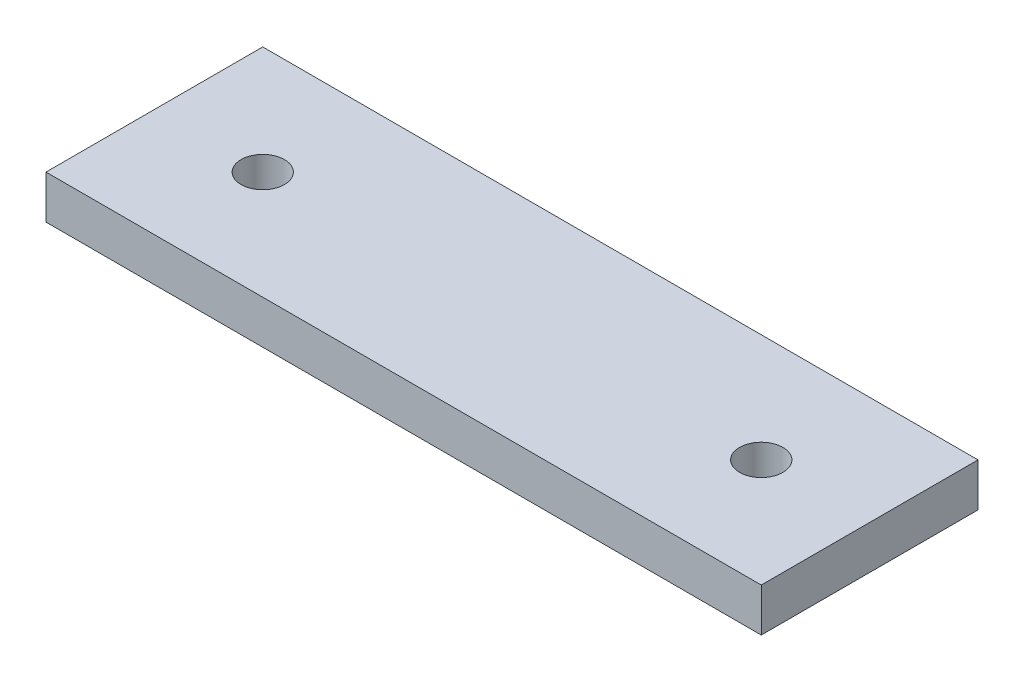
ISO-10303-21;
HEADER;
FILE_DESCRIPTION(('STEP AP214'),'2;1');
FILE_NAME('part.step','',(''),(''),'','','');
FILE_SCHEMA(('AUTOMOTIVE_DESIGN { 1 0 10303 214 1 1 1 1 }'));
ENDSEC;
DATA;
#1=APPLICATION_CONTEXT('core data for automotive mechanical design processes');
#2=APPLICATION_PROTOCOL_DEFINITION('international standard','automotive_design',2000,#1);
#3=PRODUCT_CONTEXT('',#1,'mechanical');
#4=PRODUCT('Part','Part','',(#3));
#5=PRODUCT_RELATED_PRODUCT_CATEGORY('part','',(#4));
#6=PRODUCT_DEFINITION_FORMATION('','',#4);
#7=PRODUCT_DEFINITION_CONTEXT('part definition',#1,'design');
#8=PRODUCT_DEFINITION('design','',#6,#7);
#9=PRODUCT_DEFINITION_SHAPE('','',#8);
#10=(LENGTH_UNIT() NAMED_UNIT(*) SI_UNIT(.MILLI.,.METRE.));
#11=(NAMED_UNIT(*) PLANE_ANGLE_UNIT() SI_UNIT($,.RADIAN.));
#12=(NAMED_UNIT(*) SI_UNIT($,.STERADIAN.) SOLID_ANGLE_UNIT());
#13=UNCERTAINTY_MEASURE_WITH_UNIT(LENGTH_MEASURE(1.E-05),#10,'distance_accuracy_value','');
#14=(GEOMETRIC_REPRESENTATION_CONTEXT(3) GLOBAL_UNCERTAINTY_ASSIGNED_CONTEXT((#13)) GLOBAL_UNIT_ASSIGNED_CONTEXT((#10,
#11,#12)) REPRESENTATION_CONTEXT('',''));
#15=CARTESIAN_POINT('',(0.,0.,0.));
#16=DIRECTION('',(0.,0.,1.));
#17=DIRECTION('',(1.,0.,0.));
#18=AXIS2_PLACEMENT_3D('',#15,#16,#17);
#19=CARTESIAN_POINT('',(0.,4.,0.));
#20=DIRECTION('',(1.,0.,0.));
#21=DIRECTION('',(0.,0.,-1.));
#22=AXIS2_PLACEMENT_3D('',#19,#20,#21);
#23=PLANE('',#22);
#24=DIRECTION('',(0.,0.,1.));
#25=VECTOR('',#24,1.);
#26=CARTESIAN_POINT('',(0.,0.,0.));
#27=LINE('',#26,#25);
#28=CARTESIAN_POINT('',(0.,0.,0.));
#29=VERTEX_POINT('',#28);
#30=CARTESIAN_POINT('',(0.,0.,20.));
#31=VERTEX_POINT('',#30);
#32=EDGE_CURVE('E96',#29,#31,#27,.T.);
#33=ORIENTED_EDGE('',*,*,#32,.T.);
#34=DIRECTION('',(0.,-1.,0.));
#35=VECTOR('',#34,1.);
#36=CARTESIAN_POINT('',(0.,4.,20.));
#37=LINE('',#36,#35);
#38=CARTESIAN_POINT('',(0.,4.,20.));
#39=VERTEX_POINT('',#38);
#40=EDGE_CURVE('E11',#39,#31,#37,.T.);
#41=ORIENTED_EDGE('',*,*,#40,.F.);
#42=DIRECTION('',(0.,0.,1.));
#43=VECTOR('',#42,1.);
#44=CARTESIAN_POINT('',(0.,4.,0.));
#45=LINE('',#44,#43);
#46=CARTESIAN_POINT('',(0.,4.,0.));
#47=VERTEX_POINT('',#46);
#48=EDGE_CURVE('E84',#47,#39,#45,.T.);
#49=ORIENTED_EDGE('',*,*,#48,.F.);
#50=DIRECTION('',(0.,-1.,0.));
#51=VECTOR('',#50,1.);
#52=CARTESIAN_POINT('',(0.,4.,0.));
#53=LINE('',#52,#51);
#54=EDGE_CURVE('E92',#47,#29,#53,.T.);
#55=ORIENTED_EDGE('',*,*,#54,.T.);
#56=EDGE_LOOP('',(#33,#41,#49,#55));
#57=FACE_BOUND('',#56,.T.);
#58=ADVANCED_FACE('F33',(#57),#23,.F.);
#59=CARTESIAN_POINT('',(0.,4.,20.));
#60=DIRECTION('',(0.,0.,-1.));
#61=DIRECTION('',(-1.,0.,0.));
#62=AXIS2_PLACEMENT_3D('',#59,#60,#61);
#63=PLANE('',#62);
#64=DIRECTION('',(1.,0.,0.));
#65=VECTOR('',#64,1.);
#66=CARTESIAN_POINT('',(0.,0.,20.));
#67=LINE('',#66,#65);
#68=CARTESIAN_POINT('',(66.,0.,20.));
#69=VERTEX_POINT('',#68);
#70=EDGE_CURVE('E88',#31,#69,#67,.T.);
#71=ORIENTED_EDGE('',*,*,#70,.T.);
#72=DIRECTION('',(0.,-1.,0.));
#73=VECTOR('',#72,1.);
#74=CARTESIAN_POINT('',(66.,4.,20.));
#75=LINE('',#74,#73);
#76=CARTESIAN_POINT('',(66.,4.,20.));
#77=VERTEX_POINT('',#76);
#78=EDGE_CURVE('E41',#77,#69,#75,.T.);
#79=ORIENTED_EDGE('',*,*,#78,.F.);
#80=DIRECTION('',(1.,0.,0.));
#81=VECTOR('',#80,1.);
#82=CARTESIAN_POINT('',(0.,4.,20.));
#83=LINE('',#82,#81);
#84=EDGE_CURVE('E79',#39,#77,#83,.T.);
#85=ORIENTED_EDGE('',*,*,#84,.F.);
#86=ORIENTED_EDGE('',*,*,#40,.T.);
#87=EDGE_LOOP('',(#71,#79,#85,#86));
#88=FACE_BOUND('',#87,.T.);
#89=ADVANCED_FACE('F87',(#88),#63,.F.);
#90=CARTESIAN_POINT('',(66.,4.,0.));
#91=DIRECTION('',(-1.,0.,0.));
#92=DIRECTION('',(0.,0.,1.));
#93=AXIS2_PLACEMENT_3D('',#90,#91,#92);
#94=PLANE('',#93);
#95=DIRECTION('',(0.,0.,-1.));
#96=VECTOR('',#95,1.);
#97=CARTESIAN_POINT('',(66.,0.,0.));
#98=LINE('',#97,#96);
#99=CARTESIAN_POINT('',(66.,0.,0.));
#100=VERTEX_POINT('',#99);
#101=EDGE_CURVE('E66',#69,#100,#98,.T.);
#102=ORIENTED_EDGE('',*,*,#101,.T.);
#103=DIRECTION('',(0.,-1.,0.));
#104=VECTOR('',#103,1.);
#105=CARTESIAN_POINT('',(66.,4.,0.));
#106=LINE('',#105,#104);
#107=CARTESIAN_POINT('',(66.,4.,0.));
#108=VERTEX_POINT('',#107);
#109=EDGE_CURVE('E89',#108,#100,#106,.T.);
#110=ORIENTED_EDGE('',*,*,#109,.F.);
#111=DIRECTION('',(0.,0.,-1.));
#112=VECTOR('',#111,1.);
#113=CARTESIAN_POINT('',(66.,4.,0.));
#114=LINE('',#113,#112);
#115=EDGE_CURVE('E82',#77,#108,#114,.T.);
#116=ORIENTED_EDGE('',*,*,#115,.F.);
#117=ORIENTED_EDGE('',*,*,#78,.T.);
#118=EDGE_LOOP('',(#102,#110,#116,#117));
#119=FACE_BOUND('',#118,.T.);
#120=ADVANCED_FACE('F90',(#119),#94,.F.);
#121=CARTESIAN_POINT('',(0.,4.,0.));
#122=DIRECTION('',(0.,0.,1.));
#123=DIRECTION('',(1.,0.,0.));
#124=AXIS2_PLACEMENT_3D('',#121,#122,#123);
#125=PLANE('',#124);
#126=DIRECTION('',(-1.,0.,0.));
#127=VECTOR('',#126,1.);
#128=CARTESIAN_POINT('',(0.,0.,0.));
#129=LINE('',#128,#127);
#130=EDGE_CURVE('E72',#100,#29,#129,.T.);
#131=ORIENTED_EDGE('',*,*,#130,.T.);
#132=ORIENTED_EDGE('',*,*,#54,.F.);
#133=DIRECTION('',(-1.,0.,0.));
#134=VECTOR('',#133,1.);
#135=CARTESIAN_POINT('',(0.,4.,0.));
#136=LINE('',#135,#134);
#137=EDGE_CURVE('E49',#108,#47,#136,.T.);
#138=ORIENTED_EDGE('',*,*,#137,.F.);
#139=ORIENTED_EDGE('',*,*,#109,.T.);
#140=EDGE_LOOP('',(#131,#132,#138,#139));
#141=FACE_BOUND('',#140,.T.);
#142=ADVANCED_FACE('F104',(#141),#125,.F.);
#143=CARTESIAN_POINT('',(0.,4.,0.));
#144=DIRECTION('',(0.,1.,0.));
#145=DIRECTION('',(0.,0.,1.));
#146=AXIS2_PLACEMENT_3D('',#143,#144,#145);
#147=PLANE('',#146);
#148=CARTESIAN_POINT('',(10.,4.,10.));
#149=DIRECTION('',(0.,1.,0.));
#150=DIRECTION('',(0.,0.,1.));
#151=AXIS2_PLACEMENT_3D('',#148,#149,#150);
#152=CIRCLE('',#151,2.);
#153=CARTESIAN_POINT('',(10.,4.,12.));
#154=VERTEX_POINT('',#153);
#155=EDGE_CURVE('E116',#154,#154,#152,.T.);
#156=ORIENTED_EDGE('',*,*,#155,.F.);
#157=EDGE_LOOP('',(#156));
#158=FACE_BOUND('',#157,.T.);
#159=CARTESIAN_POINT('',(56.,4.,10.));
#160=DIRECTION('',(0.,1.,0.));
#161=DIRECTION('',(0.,0.,1.));
#162=AXIS2_PLACEMENT_3D('',#159,#160,#161);
#163=CIRCLE('',#162,2.);
#164=CARTESIAN_POINT('',(56.,4.,12.));
#165=VERTEX_POINT('',#164);
#166=EDGE_CURVE('E110',#165,#165,#163,.T.);
#167=ORIENTED_EDGE('',*,*,#166,.F.);
#168=EDGE_LOOP('',(#167));
#169=FACE_BOUND('',#168,.T.);
#170=ORIENTED_EDGE('',*,*,#48,.T.);
#171=ORIENTED_EDGE('',*,*,#84,.T.);
#172=ORIENTED_EDGE('',*,*,#115,.T.);
#173=ORIENTED_EDGE('',*,*,#137,.T.);
#174=EDGE_LOOP('',(#170,#171,#172,#173));
#175=FACE_BOUND('',#174,.T.);
#176=ADVANCED_FACE('F80',(#158,#169,#175),#147,.T.);
#177=CARTESIAN_POINT('',(0.,0.,0.));
#178=DIRECTION('',(0.,1.,0.));
#179=DIRECTION('',(0.,0.,1.));
#180=AXIS2_PLACEMENT_3D('',#177,#178,#179);
#181=PLANE('',#180);
#182=CARTESIAN_POINT('',(10.,0.,10.));
#183=DIRECTION('',(0.,1.,0.));
#184=DIRECTION('',(0.,0.,1.));
#185=AXIS2_PLACEMENT_3D('',#182,#183,#184);
#186=CIRCLE('',#185,2.);
#187=CARTESIAN_POINT('',(10.,0.,12.));
#188=VERTEX_POINT('',#187);
#189=EDGE_CURVE('E99',#188,#188,#186,.T.);
#190=ORIENTED_EDGE('',*,*,#189,.T.);
#191=EDGE_LOOP('',(#190));
#192=FACE_BOUND('',#191,.T.);
#193=CARTESIAN_POINT('',(56.,0.,10.));
#194=DIRECTION('',(0.,1.,0.));
#195=DIRECTION('',(0.,0.,1.));
#196=AXIS2_PLACEMENT_3D('',#193,#194,#195);
#197=CIRCLE('',#196,2.);
#198=CARTESIAN_POINT('',(56.,0.,12.));
#199=VERTEX_POINT('',#198);
#200=EDGE_CURVE('E113',#199,#199,#197,.T.);
#201=ORIENTED_EDGE('',*,*,#200,.T.);
#202=EDGE_LOOP('',(#201));
#203=FACE_BOUND('',#202,.T.);
#204=ORIENTED_EDGE('',*,*,#32,.F.);
#205=ORIENTED_EDGE('',*,*,#130,.F.);
#206=ORIENTED_EDGE('',*,*,#101,.F.);
#207=ORIENTED_EDGE('',*,*,#70,.F.);
#208=EDGE_LOOP('',(#204,#205,#206,#207));
#209=FACE_BOUND('',#208,.T.);
#210=ADVANCED_FACE('F107',(#192,#203,#209),#181,.F.);
#211=CARTESIAN_POINT('',(56.,0.,10.));
#212=DIRECTION('',(0.,1.,0.));
#213=DIRECTION('',(0.,0.,1.));
#214=AXIS2_PLACEMENT_3D('',#211,#212,#213);
#215=CYLINDRICAL_SURFACE('',#214,2.);
#216=ORIENTED_EDGE('',*,*,#200,.F.);
#217=EDGE_LOOP('',(#216));
#218=FACE_BOUND('',#217,.T.);
#219=ORIENTED_EDGE('',*,*,#166,.T.);
#220=EDGE_LOOP('',(#219));
#221=FACE_BOUND('',#220,.T.);
#222=ADVANCED_FACE('F127',(#218,#221),#215,.F.);
#223=CARTESIAN_POINT('',(10.,0.,10.));
#224=DIRECTION('',(0.,1.,0.));
#225=DIRECTION('',(0.,0.,1.));
#226=AXIS2_PLACEMENT_3D('',#223,#224,#225);
#227=CYLINDRICAL_SURFACE('',#226,2.);
#228=ORIENTED_EDGE('',*,*,#189,.F.);
#229=EDGE_LOOP('',(#228));
#230=FACE_BOUND('',#229,.T.);
#231=ORIENTED_EDGE('',*,*,#155,.T.);
#232=EDGE_LOOP('',(#231));
#233=FACE_BOUND('',#232,.T.);
#234=ADVANCED_FACE('F124',(#230,#233),#227,.F.);
#235=CLOSED_SHELL('',(#58,#89,#120,#142,#176,#210,#222,#234));
#236=MANIFOLD_SOLID_BREP('B2',#235);
#237=ADVANCED_BREP_SHAPE_REPRESENTATION('',(#18,#236),#14);
#238=SHAPE_DEFINITION_REPRESENTATION(#9,#237);
ENDSEC;
END-ISO-10303-21;
